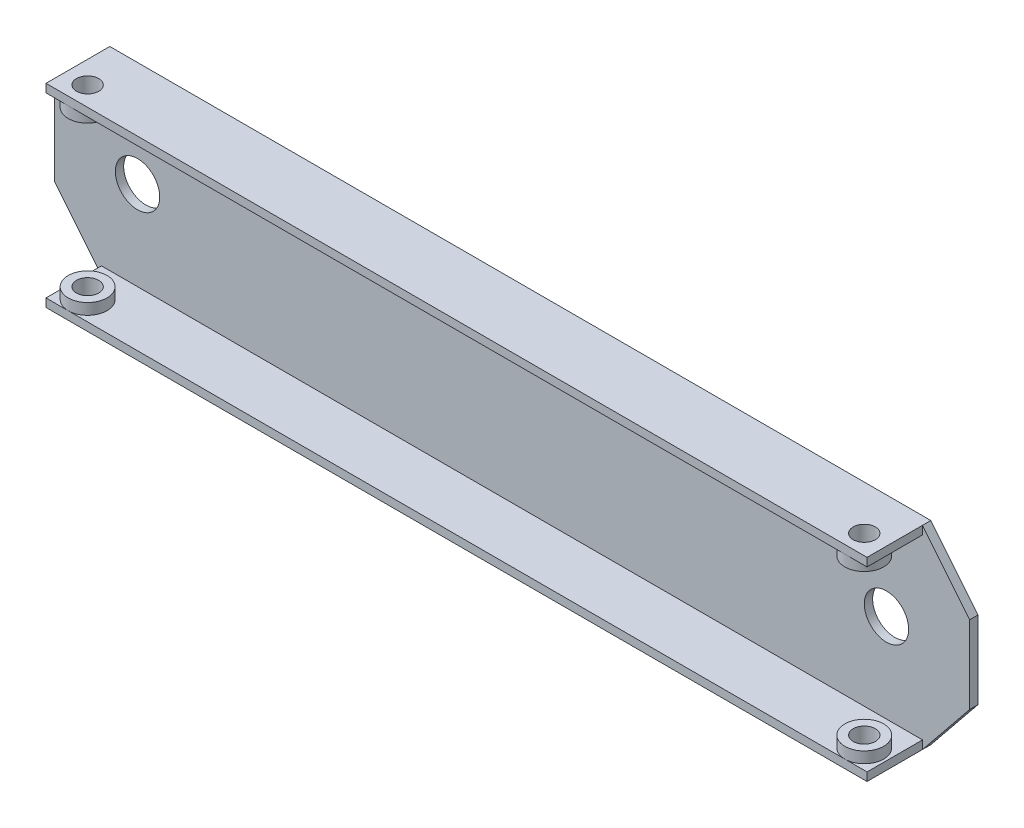
ISO-10303-21;
HEADER;
FILE_DESCRIPTION(('STEP AP214'),'2;1');
FILE_NAME('part.step','',(''),(''),'','','');
FILE_SCHEMA(('AUTOMOTIVE_DESIGN { 1 0 10303 214 1 1 1 1 }'));
ENDSEC;
DATA;
#1=APPLICATION_CONTEXT('core data for automotive mechanical design processes');
#2=APPLICATION_PROTOCOL_DEFINITION('international standard','automotive_design',2000,#1);
#3=PRODUCT_CONTEXT('',#1,'mechanical');
#4=PRODUCT('Part','Part','',(#3));
#5=PRODUCT_RELATED_PRODUCT_CATEGORY('part','',(#4));
#6=PRODUCT_DEFINITION_FORMATION('','',#4);
#7=PRODUCT_DEFINITION_CONTEXT('part definition',#1,'design');
#8=PRODUCT_DEFINITION('design','',#6,#7);
#9=PRODUCT_DEFINITION_SHAPE('','',#8);
#10=(LENGTH_UNIT() NAMED_UNIT(*) SI_UNIT(.MILLI.,.METRE.));
#11=(NAMED_UNIT(*) PLANE_ANGLE_UNIT() SI_UNIT($,.RADIAN.));
#12=(NAMED_UNIT(*) SI_UNIT($,.STERADIAN.) SOLID_ANGLE_UNIT());
#13=UNCERTAINTY_MEASURE_WITH_UNIT(LENGTH_MEASURE(1.E-05),#10,'distance_accuracy_value','');
#14=(GEOMETRIC_REPRESENTATION_CONTEXT(3) GLOBAL_UNCERTAINTY_ASSIGNED_CONTEXT((#13)) GLOBAL_UNIT_ASSIGNED_CONTEXT((#10,
#11,#12)) REPRESENTATION_CONTEXT('',''));
#15=CARTESIAN_POINT('',(0.,0.,0.));
#16=DIRECTION('',(0.,0.,1.));
#17=DIRECTION('',(1.,0.,0.));
#18=AXIS2_PLACEMENT_3D('',#15,#16,#17);
#19=CARTESIAN_POINT('',(-37.8850300015419,-6.6930632869667,11.5));
#20=DIRECTION('',(0.,-1.,0.));
#21=DIRECTION('',(0.,0.,-1.));
#22=AXIS2_PLACEMENT_3D('',#19,#20,#21);
#23=PLANE('',#22);
#24=DIRECTION('',(-1.,0.,0.));
#25=VECTOR('',#24,1.);
#26=CARTESIAN_POINT('',(-37.8850300015419,-6.6930632869667,11.5));
#27=LINE('',#26,#25);
#28=CARTESIAN_POINT('',(106.114969998458,-6.6930632869667,11.5));
#29=VERTEX_POINT('',#28);
#30=CARTESIAN_POINT('',(-33.8850300015419,-6.6930632869667,11.5));
#31=VERTEX_POINT('',#30);
#32=EDGE_CURVE('E150',#29,#31,#27,.T.);
#33=ORIENTED_EDGE('',*,*,#32,.F.);
#34=CARTESIAN_POINT('',(106.114969998458,-6.6930632869667,8.));
#35=DIRECTION('',(0.,1.,0.));
#36=DIRECTION('',(0.,0.,1.));
#37=AXIS2_PLACEMENT_3D('',#34,#35,#36);
#38=CIRCLE('',#37,3.49999999999999);
#39=EDGE_CURVE('E162',#29,#29,#38,.T.);
#40=ORIENTED_EDGE('',*,*,#39,.F.);
#41=CARTESIAN_POINT('',(110.114969998458,-6.6930632869667,11.5));
#42=VERTEX_POINT('',#41);
#43=EDGE_CURVE('E146',#42,#29,#27,.T.);
#44=ORIENTED_EDGE('',*,*,#43,.F.);
#45=DIRECTION('',(0.,0.,-1.));
#46=VECTOR('',#45,1.);
#47=CARTESIAN_POINT('',(110.114969998458,-6.6930632869667,11.5));
#48=LINE('',#47,#46);
#49=CARTESIAN_POINT('',(110.114969998458,-6.6930632869667,1.5));
#50=VERTEX_POINT('',#49);
#51=EDGE_CURVE('E181',#42,#50,#48,.T.);
#52=ORIENTED_EDGE('',*,*,#51,.T.);
#53=DIRECTION('',(-1.,0.,0.));
#54=VECTOR('',#53,1.);
#55=CARTESIAN_POINT('',(-37.8850300015419,-6.6930632869667,1.5));
#56=LINE('',#55,#54);
#57=CARTESIAN_POINT('',(-37.8850300015419,-6.6930632869667,1.5));
#58=VERTEX_POINT('',#57);
#59=EDGE_CURVE('E172',#50,#58,#56,.T.);
#60=ORIENTED_EDGE('',*,*,#59,.T.);
#61=DIRECTION('',(0.,0.,-1.));
#62=VECTOR('',#61,1.);
#63=CARTESIAN_POINT('',(-37.8850300015419,-6.6930632869667,11.5));
#64=LINE('',#63,#62);
#65=CARTESIAN_POINT('',(-37.8850300015419,-6.6930632869667,11.5));
#66=VERTEX_POINT('',#65);
#67=EDGE_CURVE('E48',#66,#58,#64,.T.);
#68=ORIENTED_EDGE('',*,*,#67,.F.);
#69=EDGE_CURVE('E159',#31,#66,#27,.T.);
#70=ORIENTED_EDGE('',*,*,#69,.F.);
#71=CARTESIAN_POINT('',(-33.8850300015419,-6.6930632869667,8.));
#72=DIRECTION('',(0.,1.,0.));
#73=DIRECTION('',(0.,0.,1.));
#74=AXIS2_PLACEMENT_3D('',#71,#72,#73);
#75=CIRCLE('',#74,3.5);
#76=EDGE_CURVE('E164',#31,#31,#75,.T.);
#77=ORIENTED_EDGE('',*,*,#76,.F.);
#78=EDGE_LOOP('',(#33,#40,#44,#52,#60,#68,#70,#77));
#79=FACE_BOUND('',#78,.T.);
#80=ADVANCED_FACE('F33',(#79),#23,.F.);
#81=CARTESIAN_POINT('',(-37.8850300015419,25.3069367130333,11.5));
#82=DIRECTION('',(0.,1.,0.));
#83=DIRECTION('',(0.,0.,1.));
#84=AXIS2_PLACEMENT_3D('',#81,#82,#83);
#85=PLANE('',#84);
#86=DIRECTION('',(1.,0.,0.));
#87=VECTOR('',#86,1.);
#88=CARTESIAN_POINT('',(-37.8850300015419,25.3069367130333,11.5));
#89=LINE('',#88,#87);
#90=CARTESIAN_POINT('',(106.114969998458,25.3069367130333,11.5));
#91=VERTEX_POINT('',#90);
#92=CARTESIAN_POINT('',(110.114969998458,25.3069367130333,11.5));
#93=VERTEX_POINT('',#92);
#94=EDGE_CURVE('E191',#91,#93,#89,.T.);
#95=ORIENTED_EDGE('',*,*,#94,.F.);
#96=CARTESIAN_POINT('',(106.114969998458,25.3069367130333,8.));
#97=DIRECTION('',(0.,-1.,0.));
#98=DIRECTION('',(0.,0.,-1.));
#99=AXIS2_PLACEMENT_3D('',#96,#97,#98);
#100=CIRCLE('',#99,3.49999999999999);
#101=EDGE_CURVE('E311',#91,#91,#100,.T.);
#102=ORIENTED_EDGE('',*,*,#101,.F.);
#103=CARTESIAN_POINT('',(-33.8850300015419,25.3069367130333,11.5));
#104=VERTEX_POINT('',#103);
#105=EDGE_CURVE('E195',#104,#91,#89,.T.);
#106=ORIENTED_EDGE('',*,*,#105,.F.);
#107=CARTESIAN_POINT('',(-33.8850300015419,25.3069367130333,8.));
#108=DIRECTION('',(0.,-1.,0.));
#109=DIRECTION('',(0.,0.,-1.));
#110=AXIS2_PLACEMENT_3D('',#107,#108,#109);
#111=CIRCLE('',#110,3.5);
#112=EDGE_CURVE('E302',#104,#104,#111,.T.);
#113=ORIENTED_EDGE('',*,*,#112,.F.);
#114=CARTESIAN_POINT('',(-37.8850300015419,25.3069367130333,11.5));
#115=VERTEX_POINT('',#114);
#116=EDGE_CURVE('E192',#115,#104,#89,.T.);
#117=ORIENTED_EDGE('',*,*,#116,.F.);
#118=DIRECTION('',(0.,0.,-1.));
#119=VECTOR('',#118,1.);
#120=CARTESIAN_POINT('',(-37.8850300015419,25.3069367130333,11.5));
#121=LINE('',#120,#119);
#122=CARTESIAN_POINT('',(-37.8850300015419,25.3069367130333,1.5));
#123=VERTEX_POINT('',#122);
#124=EDGE_CURVE('E208',#115,#123,#121,.T.);
#125=ORIENTED_EDGE('',*,*,#124,.T.);
#126=DIRECTION('',(1.,0.,0.));
#127=VECTOR('',#126,1.);
#128=CARTESIAN_POINT('',(-37.8850300015419,25.3069367130333,1.5));
#129=LINE('',#128,#127);
#130=CARTESIAN_POINT('',(110.114969998458,25.3069367130333,1.5));
#131=VERTEX_POINT('',#130);
#132=EDGE_CURVE('E200',#123,#131,#129,.T.);
#133=ORIENTED_EDGE('',*,*,#132,.T.);
#134=DIRECTION('',(0.,0.,-1.));
#135=VECTOR('',#134,1.);
#136=CARTESIAN_POINT('',(110.114969998458,25.3069367130333,11.5));
#137=LINE('',#136,#135);
#138=EDGE_CURVE('E205',#93,#131,#137,.T.);
#139=ORIENTED_EDGE('',*,*,#138,.F.);
#140=EDGE_LOOP('',(#95,#102,#106,#113,#117,#125,#133,#139));
#141=FACE_BOUND('',#140,.T.);
#142=ADVANCED_FACE('F357',(#141),#85,.F.);
#143=CARTESIAN_POINT('',(0.,0.,1.5));
#144=DIRECTION('',(0.,0.,1.));
#145=DIRECTION('',(1.,0.,0.));
#146=AXIS2_PLACEMENT_3D('',#143,#144,#145);
#147=PLANE('',#146);
#148=CARTESIAN_POINT('',(103.614969998458,9.3069367130333,1.5));
#149=DIRECTION('',(0.,0.,1.));
#150=DIRECTION('',(1.,0.,0.));
#151=AXIS2_PLACEMENT_3D('',#148,#149,#150);
#152=CIRCLE('',#151,4.00000000000001);
#153=CARTESIAN_POINT('',(107.614969998458,9.3069367130333,1.5));
#154=VERTEX_POINT('',#153);
#155=EDGE_CURVE('E348',#154,#154,#152,.T.);
#156=ORIENTED_EDGE('',*,*,#155,.F.);
#157=EDGE_LOOP('',(#156));
#158=FACE_BOUND('',#157,.T.);
#159=CARTESIAN_POINT('',(-31.3850300015419,9.30693671303331,1.5));
#160=DIRECTION('',(0.,0.,1.));
#161=DIRECTION('',(1.,0.,0.));
#162=AXIS2_PLACEMENT_3D('',#159,#160,#161);
#163=CIRCLE('',#162,4.);
#164=CARTESIAN_POINT('',(-27.3850300015419,9.30693671303331,1.5));
#165=VERTEX_POINT('',#164);
#166=EDGE_CURVE('E342',#165,#165,#163,.T.);
#167=ORIENTED_EDGE('',*,*,#166,.F.);
#168=EDGE_LOOP('',(#167));
#169=FACE_BOUND('',#168,.T.);
#170=ORIENTED_EDGE('',*,*,#59,.F.);
#171=DIRECTION('',(0.,1.,0.));
#172=VECTOR('',#171,1.);
#173=CARTESIAN_POINT('',(110.114969998458,-6.6930632869667,1.5));
#174=LINE('',#173,#172);
#175=CARTESIAN_POINT('',(110.114969998458,-8.19306328696669,1.5));
#176=VERTEX_POINT('',#175);
#177=EDGE_CURVE('E170',#176,#50,#174,.T.);
#178=ORIENTED_EDGE('',*,*,#177,.F.);
#179=DIRECTION('',(0.629198228667966,0.777244870707484,0.));
#180=VECTOR('',#179,1.);
#181=CARTESIAN_POINT('',(118.614969998458,2.30693671303332,1.5));
#182=LINE('',#181,#180);
#183=CARTESIAN_POINT('',(118.614969998458,2.30693671303332,1.5));
#184=VERTEX_POINT('',#183);
#185=EDGE_CURVE('E224',#176,#184,#182,.T.);
#186=ORIENTED_EDGE('',*,*,#185,.T.);
#187=DIRECTION('',(0.,1.,0.));
#188=VECTOR('',#187,1.);
#189=CARTESIAN_POINT('',(118.614969998458,16.3069367130333,1.5));
#190=LINE('',#189,#188);
#191=CARTESIAN_POINT('',(118.614969998458,16.3069367130333,1.5));
#192=VERTEX_POINT('',#191);
#193=EDGE_CURVE('E226',#184,#192,#190,.T.);
#194=ORIENTED_EDGE('',*,*,#193,.T.);
#195=DIRECTION('',(-0.629198228667965,0.777244870707485,0.));
#196=VECTOR('',#195,1.);
#197=CARTESIAN_POINT('',(110.114969998458,26.8069367130333,1.5));
#198=LINE('',#197,#196);
#199=CARTESIAN_POINT('',(110.114969998458,26.8069367130333,1.5));
#200=VERTEX_POINT('',#199);
#201=EDGE_CURVE('E228',#192,#200,#198,.T.);
#202=ORIENTED_EDGE('',*,*,#201,.T.);
#203=DIRECTION('',(0.,1.,0.));
#204=VECTOR('',#203,1.);
#205=CARTESIAN_POINT('',(110.114969998458,25.3069367130333,1.5));
#206=LINE('',#205,#204);
#207=EDGE_CURVE('E56',#131,#200,#206,.T.);
#208=ORIENTED_EDGE('',*,*,#207,.F.);
#209=ORIENTED_EDGE('',*,*,#132,.F.);
#210=DIRECTION('',(0.,-1.,0.));
#211=VECTOR('',#210,1.);
#212=CARTESIAN_POINT('',(-37.8850300015419,26.8069367130333,1.5));
#213=LINE('',#212,#211);
#214=CARTESIAN_POINT('',(-37.8850300015419,26.8069367130333,1.5));
#215=VERTEX_POINT('',#214);
#216=EDGE_CURVE('E185',#215,#123,#213,.T.);
#217=ORIENTED_EDGE('',*,*,#216,.F.);
#218=DIRECTION('',(-0.629198228667965,-0.777244870707485,0.));
#219=VECTOR('',#218,1.);
#220=CARTESIAN_POINT('',(-37.8850300015419,26.8069367130333,1.5));
#221=LINE('',#220,#219);
#222=CARTESIAN_POINT('',(-46.3850300015419,16.3069367130333,1.5));
#223=VERTEX_POINT('',#222);
#224=EDGE_CURVE('E215',#215,#223,#221,.T.);
#225=ORIENTED_EDGE('',*,*,#224,.T.);
#226=DIRECTION('',(0.,-1.,0.));
#227=VECTOR('',#226,1.);
#228=CARTESIAN_POINT('',(-46.3850300015419,16.3069367130333,1.5));
#229=LINE('',#228,#227);
#230=CARTESIAN_POINT('',(-46.3850300015419,2.3069367130333,1.5));
#231=VERTEX_POINT('',#230);
#232=EDGE_CURVE('E218',#223,#231,#229,.T.);
#233=ORIENTED_EDGE('',*,*,#232,.T.);
#234=DIRECTION('',(0.629198228667966,-0.777244870707484,0.));
#235=VECTOR('',#234,1.);
#236=CARTESIAN_POINT('',(-46.3850300015419,2.3069367130333,1.5));
#237=LINE('',#236,#235);
#238=CARTESIAN_POINT('',(-37.8850300015419,-8.1930632869667,1.5));
#239=VERTEX_POINT('',#238);
#240=EDGE_CURVE('E221',#231,#239,#237,.T.);
#241=ORIENTED_EDGE('',*,*,#240,.T.);
#242=DIRECTION('',(0.,-1.,0.));
#243=VECTOR('',#242,1.);
#244=CARTESIAN_POINT('',(-37.8850300015419,-8.1930632869667,1.5));
#245=LINE('',#244,#243);
#246=EDGE_CURVE('E175',#58,#239,#245,.T.);
#247=ORIENTED_EDGE('',*,*,#246,.F.);
#248=EDGE_LOOP('',(#170,#178,#186,#194,#202,#208,#209,#217,#225,#233,#241,#247));
#249=FACE_BOUND('',#248,.T.);
#250=ADVANCED_FACE('F287',(#158,#169,#249),#147,.T.);
#251=CARTESIAN_POINT('',(-37.8850300015419,26.8069367130333,1.5));
#252=DIRECTION('',(0.777244870707485,-0.629198228667965,0.));
#253=DIRECTION('',(0.629198228667965,0.777244870707485,0.));
#254=AXIS2_PLACEMENT_3D('',#251,#252,#253);
#255=PLANE('',#254);
#256=DIRECTION('',(-0.629198228667965,-0.777244870707485,0.));
#257=VECTOR('',#256,1.);
#258=CARTESIAN_POINT('',(-37.8850300015419,26.8069367130333,0.));
#259=LINE('',#258,#257);
#260=CARTESIAN_POINT('',(-37.8850300015419,26.8069367130333,0.));
#261=VERTEX_POINT('',#260);
#262=CARTESIAN_POINT('',(-46.3850300015419,16.3069367130333,0.));
#263=VERTEX_POINT('',#262);
#264=EDGE_CURVE('E214',#261,#263,#259,.T.);
#265=ORIENTED_EDGE('',*,*,#264,.T.);
#266=DIRECTION('',(0.,0.,-1.));
#267=VECTOR('',#266,1.);
#268=CARTESIAN_POINT('',(-46.3850300015419,16.3069367130333,1.5));
#269=LINE('',#268,#267);
#270=EDGE_CURVE('E11',#223,#263,#269,.T.);
#271=ORIENTED_EDGE('',*,*,#270,.F.);
#272=ORIENTED_EDGE('',*,*,#224,.F.);
#273=DIRECTION('',(0.,0.,-1.));
#274=VECTOR('',#273,1.);
#275=CARTESIAN_POINT('',(-37.8850300015419,26.8069367130333,1.5));
#276=LINE('',#275,#274);
#277=EDGE_CURVE('E230',#215,#261,#276,.T.);
#278=ORIENTED_EDGE('',*,*,#277,.T.);
#279=EDGE_LOOP('',(#265,#271,#272,#278));
#280=FACE_BOUND('',#279,.T.);
#281=ADVANCED_FACE('F35',(#280),#255,.F.);
#282=CARTESIAN_POINT('',(-46.3850300015419,16.3069367130333,1.5));
#283=DIRECTION('',(1.,0.,0.));
#284=DIRECTION('',(0.,1.,0.));
#285=AXIS2_PLACEMENT_3D('',#282,#283,#284);
#286=PLANE('',#285);
#287=DIRECTION('',(0.,-1.,0.));
#288=VECTOR('',#287,1.);
#289=CARTESIAN_POINT('',(-46.3850300015419,16.3069367130333,0.));
#290=LINE('',#289,#288);
#291=CARTESIAN_POINT('',(-46.3850300015419,2.3069367130333,0.));
#292=VERTEX_POINT('',#291);
#293=EDGE_CURVE('E233',#263,#292,#290,.T.);
#294=ORIENTED_EDGE('',*,*,#293,.T.);
#295=DIRECTION('',(0.,0.,-1.));
#296=VECTOR('',#295,1.);
#297=CARTESIAN_POINT('',(-46.3850300015419,2.3069367130333,1.5));
#298=LINE('',#297,#296);
#299=EDGE_CURVE('E41',#231,#292,#298,.T.);
#300=ORIENTED_EDGE('',*,*,#299,.F.);
#301=ORIENTED_EDGE('',*,*,#232,.F.);
#302=ORIENTED_EDGE('',*,*,#270,.T.);
#303=EDGE_LOOP('',(#294,#300,#301,#302));
#304=FACE_BOUND('',#303,.T.);
#305=ADVANCED_FACE('F616',(#304),#286,.F.);
#306=CARTESIAN_POINT('',(-46.3850300015419,2.3069367130333,1.5));
#307=DIRECTION('',(0.777244870707484,0.629198228667966,0.));
#308=DIRECTION('',(-0.629198228667966,0.777244870707484,0.));
#309=AXIS2_PLACEMENT_3D('',#306,#307,#308);
#310=PLANE('',#309);
#311=DIRECTION('',(0.629198228667966,-0.777244870707484,0.));
#312=VECTOR('',#311,1.);
#313=CARTESIAN_POINT('',(-46.3850300015419,2.3069367130333,0.));
#314=LINE('',#313,#312);
#315=CARTESIAN_POINT('',(-37.8850300015419,-8.1930632869667,0.));
#316=VERTEX_POINT('',#315);
#317=EDGE_CURVE('E235',#292,#316,#314,.T.);
#318=ORIENTED_EDGE('',*,*,#317,.T.);
#319=DIRECTION('',(0.,0.,-1.));
#320=VECTOR('',#319,1.);
#321=CARTESIAN_POINT('',(-37.8850300015419,-8.1930632869667,1.5));
#322=LINE('',#321,#320);
#323=EDGE_CURVE('E260',#239,#316,#322,.T.);
#324=ORIENTED_EDGE('',*,*,#323,.F.);
#325=ORIENTED_EDGE('',*,*,#240,.F.);
#326=ORIENTED_EDGE('',*,*,#299,.T.);
#327=EDGE_LOOP('',(#318,#324,#325,#326));
#328=FACE_BOUND('',#327,.T.);
#329=ADVANCED_FACE('F267',(#328),#310,.F.);
#330=CARTESIAN_POINT('',(-37.8850300015419,-8.1930632869667,1.5));
#331=DIRECTION('',(0.,1.,0.));
#332=DIRECTION('',(-1.,0.,0.));
#333=AXIS2_PLACEMENT_3D('',#330,#331,#332);
#334=PLANE('',#333);
#335=CARTESIAN_POINT('',(106.114969998458,-8.1930632869667,8.));
#336=DIRECTION('',(0.,-1.,0.));
#337=DIRECTION('',(0.,0.,-1.));
#338=AXIS2_PLACEMENT_3D('',#335,#336,#337);
#339=CIRCLE('',#338,2.);
#340=CARTESIAN_POINT('',(106.114969998458,-8.1930632869667,6.));
#341=VERTEX_POINT('',#340);
#342=EDGE_CURVE('E329',#341,#341,#339,.T.);
#343=ORIENTED_EDGE('',*,*,#342,.F.);
#344=EDGE_LOOP('',(#343));
#345=FACE_BOUND('',#344,.T.);
#346=CARTESIAN_POINT('',(-33.8850300015419,-8.1930632869667,8.));
#347=DIRECTION('',(0.,-1.,0.));
#348=DIRECTION('',(0.,0.,-1.));
#349=AXIS2_PLACEMENT_3D('',#346,#347,#348);
#350=CIRCLE('',#349,2.);
#351=CARTESIAN_POINT('',(-33.8850300015419,-8.1930632869667,6.));
#352=VERTEX_POINT('',#351);
#353=EDGE_CURVE('E319',#352,#352,#350,.T.);
#354=ORIENTED_EDGE('',*,*,#353,.F.);
#355=EDGE_LOOP('',(#354));
#356=FACE_BOUND('',#355,.T.);
#357=DIRECTION('',(1.,0.,0.));
#358=VECTOR('',#357,1.);
#359=CARTESIAN_POINT('',(-37.8850300015419,-8.1930632869667,0.));
#360=LINE('',#359,#358);
#361=CARTESIAN_POINT('',(110.114969998458,-8.19306328696669,0.));
#362=VERTEX_POINT('',#361);
#363=EDGE_CURVE('E237',#316,#362,#360,.T.);
#364=ORIENTED_EDGE('',*,*,#363,.T.);
#365=DIRECTION('',(0.,0.,-1.));
#366=VECTOR('',#365,1.);
#367=CARTESIAN_POINT('',(110.114969998458,-8.19306328696669,1.5));
#368=LINE('',#367,#366);
#369=EDGE_CURVE('E257',#176,#362,#368,.T.);
#370=ORIENTED_EDGE('',*,*,#369,.F.);
#371=DIRECTION('',(0.,0.,-1.));
#372=VECTOR('',#371,1.);
#373=CARTESIAN_POINT('',(110.114969998458,-8.19306328696669,11.5));
#374=LINE('',#373,#372);
#375=CARTESIAN_POINT('',(110.114969998458,-8.19306328696669,11.5));
#376=VERTEX_POINT('',#375);
#377=EDGE_CURVE('E183',#376,#176,#374,.T.);
#378=ORIENTED_EDGE('',*,*,#377,.F.);
#379=DIRECTION('',(1.,0.,0.));
#380=VECTOR('',#379,1.);
#381=CARTESIAN_POINT('',(110.114969998458,-8.19306328696669,11.5));
#382=LINE('',#381,#380);
#383=CARTESIAN_POINT('',(-37.8850300015419,-8.1930632869667,11.5));
#384=VERTEX_POINT('',#383);
#385=EDGE_CURVE('E177',#384,#376,#382,.T.);
#386=ORIENTED_EDGE('',*,*,#385,.F.);
#387=DIRECTION('',(0.,0.,-1.));
#388=VECTOR('',#387,1.);
#389=CARTESIAN_POINT('',(-37.8850300015419,-8.1930632869667,11.5));
#390=LINE('',#389,#388);
#391=EDGE_CURVE('E169',#384,#239,#390,.T.);
#392=ORIENTED_EDGE('',*,*,#391,.T.);
#393=ORIENTED_EDGE('',*,*,#323,.T.);
#394=EDGE_LOOP('',(#364,#370,#378,#386,#392,#393));
#395=FACE_BOUND('',#394,.T.);
#396=ADVANCED_FACE('F278',(#345,#356,#395),#334,.F.);
#397=CARTESIAN_POINT('',(118.614969998458,2.30693671303332,1.5));
#398=DIRECTION('',(-0.777244870707484,0.629198228667966,0.));
#399=DIRECTION('',(-0.629198228667966,-0.777244870707484,0.));
#400=AXIS2_PLACEMENT_3D('',#397,#398,#399);
#401=PLANE('',#400);
#402=DIRECTION('',(0.629198228667966,0.777244870707484,0.));
#403=VECTOR('',#402,1.);
#404=CARTESIAN_POINT('',(118.614969998458,2.30693671303332,0.));
#405=LINE('',#404,#403);
#406=CARTESIAN_POINT('',(118.614969998458,2.30693671303332,0.));
#407=VERTEX_POINT('',#406);
#408=EDGE_CURVE('E239',#362,#407,#405,.T.);
#409=ORIENTED_EDGE('',*,*,#408,.T.);
#410=DIRECTION('',(0.,0.,-1.));
#411=VECTOR('',#410,1.);
#412=CARTESIAN_POINT('',(118.614969998458,2.30693671303332,1.5));
#413=LINE('',#412,#411);
#414=EDGE_CURVE('E254',#184,#407,#413,.T.);
#415=ORIENTED_EDGE('',*,*,#414,.F.);
#416=ORIENTED_EDGE('',*,*,#185,.F.);
#417=ORIENTED_EDGE('',*,*,#369,.T.);
#418=EDGE_LOOP('',(#409,#415,#416,#417));
#419=FACE_BOUND('',#418,.T.);
#420=ADVANCED_FACE('F282',(#419),#401,.F.);
#421=CARTESIAN_POINT('',(118.614969998458,16.3069367130333,1.5));
#422=DIRECTION('',(-1.,0.,0.));
#423=DIRECTION('',(0.,-1.,0.));
#424=AXIS2_PLACEMENT_3D('',#421,#422,#423);
#425=PLANE('',#424);
#426=DIRECTION('',(0.,1.,0.));
#427=VECTOR('',#426,1.);
#428=CARTESIAN_POINT('',(118.614969998458,16.3069367130333,0.));
#429=LINE('',#428,#427);
#430=CARTESIAN_POINT('',(118.614969998458,16.3069367130333,0.));
#431=VERTEX_POINT('',#430);
#432=EDGE_CURVE('E241',#407,#431,#429,.T.);
#433=ORIENTED_EDGE('',*,*,#432,.T.);
#434=DIRECTION('',(0.,0.,-1.));
#435=VECTOR('',#434,1.);
#436=CARTESIAN_POINT('',(118.614969998458,16.3069367130333,1.5));
#437=LINE('',#436,#435);
#438=EDGE_CURVE('E251',#192,#431,#437,.T.);
#439=ORIENTED_EDGE('',*,*,#438,.F.);
#440=ORIENTED_EDGE('',*,*,#193,.F.);
#441=ORIENTED_EDGE('',*,*,#414,.T.);
#442=EDGE_LOOP('',(#433,#439,#440,#441));
#443=FACE_BOUND('',#442,.T.);
#444=ADVANCED_FACE('F625',(#443),#425,.F.);
#445=CARTESIAN_POINT('',(110.114969998458,26.8069367130333,1.5));
#446=DIRECTION('',(-0.777244870707485,-0.629198228667965,0.));
#447=DIRECTION('',(0.629198228667965,-0.777244870707485,0.));
#448=AXIS2_PLACEMENT_3D('',#445,#446,#447);
#449=PLANE('',#448);
#450=DIRECTION('',(-0.629198228667965,0.777244870707485,0.));
#451=VECTOR('',#450,1.);
#452=CARTESIAN_POINT('',(110.114969998458,26.8069367130333,0.));
#453=LINE('',#452,#451);
#454=CARTESIAN_POINT('',(110.114969998458,26.8069367130333,0.));
#455=VERTEX_POINT('',#454);
#456=EDGE_CURVE('E243',#431,#455,#453,.T.);
#457=ORIENTED_EDGE('',*,*,#456,.T.);
#458=DIRECTION('',(0.,0.,-1.));
#459=VECTOR('',#458,1.);
#460=CARTESIAN_POINT('',(110.114969998458,26.8069367130333,1.5));
#461=LINE('',#460,#459);
#462=EDGE_CURVE('E248',#200,#455,#461,.T.);
#463=ORIENTED_EDGE('',*,*,#462,.F.);
#464=ORIENTED_EDGE('',*,*,#201,.F.);
#465=ORIENTED_EDGE('',*,*,#438,.T.);
#466=EDGE_LOOP('',(#457,#463,#464,#465));
#467=FACE_BOUND('',#466,.T.);
#468=ADVANCED_FACE('F380',(#467),#449,.F.);
#469=CARTESIAN_POINT('',(-37.8850300015419,26.8069367130333,1.5));
#470=DIRECTION('',(0.,-1.,0.));
#471=DIRECTION('',(1.,0.,0.));
#472=AXIS2_PLACEMENT_3D('',#469,#470,#471);
#473=PLANE('',#472);
#474=CARTESIAN_POINT('',(-33.8850300015419,26.8069367130333,8.));
#475=DIRECTION('',(0.,1.,0.));
#476=DIRECTION('',(0.,0.,1.));
#477=AXIS2_PLACEMENT_3D('',#474,#475,#476);
#478=CIRCLE('',#477,2.);
#479=CARTESIAN_POINT('',(-33.8850300015419,26.8069367130333,10.));
#480=VERTEX_POINT('',#479);
#481=EDGE_CURVE('E298',#480,#480,#478,.T.);
#482=ORIENTED_EDGE('',*,*,#481,.F.);
#483=EDGE_LOOP('',(#482));
#484=FACE_BOUND('',#483,.T.);
#485=CARTESIAN_POINT('',(106.114969998458,26.8069367130333,8.));
#486=DIRECTION('',(0.,1.,0.));
#487=DIRECTION('',(0.,0.,1.));
#488=AXIS2_PLACEMENT_3D('',#485,#486,#487);
#489=CIRCLE('',#488,2.);
#490=CARTESIAN_POINT('',(106.114969998458,26.8069367130333,10.));
#491=VERTEX_POINT('',#490);
#492=EDGE_CURVE('E173',#491,#491,#489,.T.);
#493=ORIENTED_EDGE('',*,*,#492,.F.);
#494=EDGE_LOOP('',(#493));
#495=FACE_BOUND('',#494,.T.);
#496=DIRECTION('',(-1.,0.,0.));
#497=VECTOR('',#496,1.);
#498=CARTESIAN_POINT('',(-37.8850300015419,26.8069367130333,0.));
#499=LINE('',#498,#497);
#500=EDGE_CURVE('E219',#455,#261,#499,.T.);
#501=ORIENTED_EDGE('',*,*,#500,.T.);
#502=ORIENTED_EDGE('',*,*,#277,.F.);
#503=DIRECTION('',(0.,0.,-1.));
#504=VECTOR('',#503,1.);
#505=CARTESIAN_POINT('',(-37.8850300015419,26.8069367130333,11.5));
#506=LINE('',#505,#504);
#507=CARTESIAN_POINT('',(-37.8850300015419,26.8069367130333,11.5));
#508=VERTEX_POINT('',#507);
#509=EDGE_CURVE('E211',#508,#215,#506,.T.);
#510=ORIENTED_EDGE('',*,*,#509,.F.);
#511=DIRECTION('',(-1.,0.,0.));
#512=VECTOR('',#511,1.);
#513=CARTESIAN_POINT('',(110.114969998458,26.8069367130333,11.5));
#514=LINE('',#513,#512);
#515=CARTESIAN_POINT('',(110.114969998458,26.8069367130333,11.5));
#516=VERTEX_POINT('',#515);
#517=EDGE_CURVE('E186',#516,#508,#514,.T.);
#518=ORIENTED_EDGE('',*,*,#517,.F.);
#519=DIRECTION('',(0.,0.,-1.));
#520=VECTOR('',#519,1.);
#521=CARTESIAN_POINT('',(110.114969998458,26.8069367130333,11.5));
#522=LINE('',#521,#520);
#523=EDGE_CURVE('E197',#516,#200,#522,.T.);
#524=ORIENTED_EDGE('',*,*,#523,.T.);
#525=ORIENTED_EDGE('',*,*,#462,.T.);
#526=EDGE_LOOP('',(#501,#502,#510,#518,#524,#525));
#527=FACE_BOUND('',#526,.T.);
#528=ADVANCED_FACE('F370',(#484,#495,#527),#473,.F.);
#529=CARTESIAN_POINT('',(0.,0.,0.));
#530=DIRECTION('',(0.,0.,1.));
#531=DIRECTION('',(1.,0.,0.));
#532=AXIS2_PLACEMENT_3D('',#529,#530,#531);
#533=PLANE('',#532);
#534=CARTESIAN_POINT('',(103.614969998458,9.3069367130333,0.));
#535=DIRECTION('',(0.,0.,1.));
#536=DIRECTION('',(1.,0.,0.));
#537=AXIS2_PLACEMENT_3D('',#534,#535,#536);
#538=CIRCLE('',#537,4.00000000000001);
#539=CARTESIAN_POINT('',(107.614969998458,9.3069367130333,0.));
#540=VERTEX_POINT('',#539);
#541=EDGE_CURVE('E345',#540,#540,#538,.F.);
#542=ORIENTED_EDGE('',*,*,#541,.F.);
#543=EDGE_LOOP('',(#542));
#544=FACE_BOUND('',#543,.T.);
#545=CARTESIAN_POINT('',(-31.3850300015419,9.30693671303331,0.));
#546=DIRECTION('',(0.,0.,1.));
#547=DIRECTION('',(1.,0.,0.));
#548=AXIS2_PLACEMENT_3D('',#545,#546,#547);
#549=CIRCLE('',#548,4.);
#550=CARTESIAN_POINT('',(-27.3850300015419,9.30693671303331,0.));
#551=VERTEX_POINT('',#550);
#552=EDGE_CURVE('E339',#551,#551,#549,.F.);
#553=ORIENTED_EDGE('',*,*,#552,.F.);
#554=EDGE_LOOP('',(#553));
#555=FACE_BOUND('',#554,.T.);
#556=ORIENTED_EDGE('',*,*,#264,.F.);
#557=ORIENTED_EDGE('',*,*,#500,.F.);
#558=ORIENTED_EDGE('',*,*,#456,.F.);
#559=ORIENTED_EDGE('',*,*,#432,.F.);
#560=ORIENTED_EDGE('',*,*,#408,.F.);
#561=ORIENTED_EDGE('',*,*,#363,.F.);
#562=ORIENTED_EDGE('',*,*,#317,.F.);
#563=ORIENTED_EDGE('',*,*,#293,.F.);
#564=EDGE_LOOP('',(#556,#557,#558,#559,#560,#561,#562,#563));
#565=FACE_BOUND('',#564,.T.);
#566=ADVANCED_FACE('F273',(#544,#555,#565),#533,.F.);
#567=CARTESIAN_POINT('',(-37.8850300015419,26.8069367130333,11.5));
#568=DIRECTION('',(1.,0.,0.));
#569=DIRECTION('',(0.,0.,-1.));
#570=AXIS2_PLACEMENT_3D('',#567,#568,#569);
#571=PLANE('',#570);
#572=ORIENTED_EDGE('',*,*,#216,.T.);
#573=ORIENTED_EDGE('',*,*,#124,.F.);
#574=DIRECTION('',(0.,-1.,0.));
#575=VECTOR('',#574,1.);
#576=CARTESIAN_POINT('',(-37.8850300015419,26.8069367130333,11.5));
#577=LINE('',#576,#575);
#578=EDGE_CURVE('E189',#508,#115,#577,.T.);
#579=ORIENTED_EDGE('',*,*,#578,.F.);
#580=ORIENTED_EDGE('',*,*,#509,.T.);
#581=EDGE_LOOP('',(#572,#573,#579,#580));
#582=FACE_BOUND('',#581,.T.);
#583=ADVANCED_FACE('F369',(#582),#571,.F.);
#584=CARTESIAN_POINT('',(110.114969998458,25.3069367130333,11.5));
#585=DIRECTION('',(-1.,0.,0.));
#586=DIRECTION('',(0.,0.,1.));
#587=AXIS2_PLACEMENT_3D('',#584,#585,#586);
#588=PLANE('',#587);
#589=ORIENTED_EDGE('',*,*,#207,.T.);
#590=ORIENTED_EDGE('',*,*,#523,.F.);
#591=DIRECTION('',(0.,1.,0.));
#592=VECTOR('',#591,1.);
#593=CARTESIAN_POINT('',(110.114969998458,25.3069367130333,11.5));
#594=LINE('',#593,#592);
#595=EDGE_CURVE('E194',#93,#516,#594,.T.);
#596=ORIENTED_EDGE('',*,*,#595,.F.);
#597=ORIENTED_EDGE('',*,*,#138,.T.);
#598=EDGE_LOOP('',(#589,#590,#596,#597));
#599=FACE_BOUND('',#598,.T.);
#600=ADVANCED_FACE('F377',(#599),#588,.F.);
#601=CARTESIAN_POINT('',(0.,0.,11.5));
#602=DIRECTION('',(0.,0.,1.));
#603=DIRECTION('',(1.,0.,0.));
#604=AXIS2_PLACEMENT_3D('',#601,#602,#603);
#605=PLANE('',#604);
#606=ORIENTED_EDGE('',*,*,#517,.T.);
#607=ORIENTED_EDGE('',*,*,#578,.T.);
#608=ORIENTED_EDGE('',*,*,#116,.T.);
#609=ORIENTED_EDGE('',*,*,#105,.T.);
#610=ORIENTED_EDGE('',*,*,#94,.T.);
#611=ORIENTED_EDGE('',*,*,#595,.T.);
#612=EDGE_LOOP('',(#606,#607,#608,#609,#610,#611));
#613=FACE_BOUND('',#612,.T.);
#614=ADVANCED_FACE('F396',(#613),#605,.T.);
#615=CARTESIAN_POINT('',(110.114969998458,-6.6930632869667,11.5));
#616=DIRECTION('',(-1.,0.,0.));
#617=DIRECTION('',(0.,0.,1.));
#618=AXIS2_PLACEMENT_3D('',#615,#616,#617);
#619=PLANE('',#618);
#620=ORIENTED_EDGE('',*,*,#177,.T.);
#621=ORIENTED_EDGE('',*,*,#51,.F.);
#622=DIRECTION('',(0.,1.,0.));
#623=VECTOR('',#622,1.);
#624=CARTESIAN_POINT('',(110.114969998458,-6.6930632869667,11.5));
#625=LINE('',#624,#623);
#626=EDGE_CURVE('E152',#376,#42,#625,.T.);
#627=ORIENTED_EDGE('',*,*,#626,.F.);
#628=ORIENTED_EDGE('',*,*,#377,.T.);
#629=EDGE_LOOP('',(#620,#621,#627,#628));
#630=FACE_BOUND('',#629,.T.);
#631=ADVANCED_FACE('F291',(#630),#619,.F.);
#632=CARTESIAN_POINT('',(-37.8850300015419,-8.1930632869667,11.5));
#633=DIRECTION('',(1.,0.,0.));
#634=DIRECTION('',(0.,0.,-1.));
#635=AXIS2_PLACEMENT_3D('',#632,#633,#634);
#636=PLANE('',#635);
#637=ORIENTED_EDGE('',*,*,#246,.T.);
#638=ORIENTED_EDGE('',*,*,#391,.F.);
#639=DIRECTION('',(0.,-1.,0.));
#640=VECTOR('',#639,1.);
#641=CARTESIAN_POINT('',(-37.8850300015419,-8.1930632869667,11.5));
#642=LINE('',#641,#640);
#643=EDGE_CURVE('E157',#66,#384,#642,.T.);
#644=ORIENTED_EDGE('',*,*,#643,.F.);
#645=ORIENTED_EDGE('',*,*,#67,.T.);
#646=EDGE_LOOP('',(#637,#638,#644,#645));
#647=FACE_BOUND('',#646,.T.);
#648=ADVANCED_FACE('F293',(#647),#636,.F.);
#649=CARTESIAN_POINT('',(0.,0.,11.5));
#650=DIRECTION('',(0.,0.,-1.));
#651=DIRECTION('',(-1.,0.,0.));
#652=AXIS2_PLACEMENT_3D('',#649,#650,#651);
#653=PLANE('',#652);
#654=ORIENTED_EDGE('',*,*,#385,.T.);
#655=ORIENTED_EDGE('',*,*,#626,.T.);
#656=ORIENTED_EDGE('',*,*,#43,.T.);
#657=ORIENTED_EDGE('',*,*,#32,.T.);
#658=ORIENTED_EDGE('',*,*,#69,.T.);
#659=ORIENTED_EDGE('',*,*,#643,.T.);
#660=EDGE_LOOP('',(#654,#655,#656,#657,#658,#659));
#661=FACE_BOUND('',#660,.T.);
#662=ADVANCED_FACE('F149',(#661),#653,.F.);
#663=CARTESIAN_POINT('',(106.114969998458,23.3069367130333,8.));
#664=DIRECTION('',(0.,1.,0.));
#665=DIRECTION('',(0.,0.,1.));
#666=AXIS2_PLACEMENT_3D('',#663,#664,#665);
#667=CYLINDRICAL_SURFACE('',#666,2.);
#668=ORIENTED_EDGE('',*,*,#492,.T.);
#669=EDGE_LOOP('',(#668));
#670=FACE_BOUND('',#669,.T.);
#671=CARTESIAN_POINT('',(106.114969998458,23.3069367130333,8.));
#672=DIRECTION('',(0.,-1.,0.));
#673=DIRECTION('',(0.,0.,-1.));
#674=AXIS2_PLACEMENT_3D('',#671,#672,#673);
#675=CIRCLE('',#674,2.);
#676=CARTESIAN_POINT('',(106.114969998458,23.3069367130333,6.));
#677=VERTEX_POINT('',#676);
#678=EDGE_CURVE('E314',#677,#677,#675,.T.);
#679=ORIENTED_EDGE('',*,*,#678,.T.);
#680=EDGE_LOOP('',(#679));
#681=FACE_BOUND('',#680,.T.);
#682=ADVANCED_FACE('F445',(#670,#681),#667,.F.);
#683=CARTESIAN_POINT('',(-33.8850300015419,23.3069367130333,8.));
#684=DIRECTION('',(0.,1.,0.));
#685=DIRECTION('',(0.,0.,1.));
#686=AXIS2_PLACEMENT_3D('',#683,#684,#685);
#687=CYLINDRICAL_SURFACE('',#686,2.);
#688=ORIENTED_EDGE('',*,*,#481,.T.);
#689=EDGE_LOOP('',(#688));
#690=FACE_BOUND('',#689,.T.);
#691=CARTESIAN_POINT('',(-33.8850300015419,23.3069367130333,8.));
#692=DIRECTION('',(0.,-1.,0.));
#693=DIRECTION('',(0.,0.,-1.));
#694=AXIS2_PLACEMENT_3D('',#691,#692,#693);
#695=CIRCLE('',#694,2.);
#696=CARTESIAN_POINT('',(-33.8850300015419,23.3069367130333,6.));
#697=VERTEX_POINT('',#696);
#698=EDGE_CURVE('E305',#697,#697,#695,.T.);
#699=ORIENTED_EDGE('',*,*,#698,.T.);
#700=EDGE_LOOP('',(#699));
#701=FACE_BOUND('',#700,.T.);
#702=ADVANCED_FACE('F441',(#690,#701),#687,.F.);
#703=CARTESIAN_POINT('',(-33.8850300015419,23.3069367130333,8.));
#704=DIRECTION('',(0.,1.,0.));
#705=DIRECTION('',(0.,0.,1.));
#706=AXIS2_PLACEMENT_3D('',#703,#704,#705);
#707=CYLINDRICAL_SURFACE('',#706,3.5);
#708=CARTESIAN_POINT('',(-33.8850300015419,23.3069367130333,8.));
#709=DIRECTION('',(0.,-1.,0.));
#710=DIRECTION('',(0.,0.,-1.));
#711=AXIS2_PLACEMENT_3D('',#708,#709,#710);
#712=CIRCLE('',#711,3.5);
#713=CARTESIAN_POINT('',(-33.8850300015419,23.3069367130333,4.5));
#714=VERTEX_POINT('',#713);
#715=EDGE_CURVE('E301',#714,#714,#712,.T.);
#716=ORIENTED_EDGE('',*,*,#715,.F.);
#717=EDGE_LOOP('',(#716));
#718=FACE_BOUND('',#717,.T.);
#719=ORIENTED_EDGE('',*,*,#112,.T.);
#720=EDGE_LOOP('',(#719));
#721=FACE_BOUND('',#720,.T.);
#722=ADVANCED_FACE('F433',(#718,#721),#707,.T.);
#723=CARTESIAN_POINT('',(-33.8850300015419,23.3069367130333,8.));
#724=DIRECTION('',(0.,-1.,0.));
#725=DIRECTION('',(0.,0.,-1.));
#726=AXIS2_PLACEMENT_3D('',#723,#724,#725);
#727=PLANE('',#726);
#728=ORIENTED_EDGE('',*,*,#698,.F.);
#729=EDGE_LOOP('',(#728));
#730=FACE_BOUND('',#729,.T.);
#731=ORIENTED_EDGE('',*,*,#715,.T.);
#732=EDGE_LOOP('',(#731));
#733=FACE_BOUND('',#732,.T.);
#734=ADVANCED_FACE('F423',(#730,#733),#727,.T.);
#735=CARTESIAN_POINT('',(106.114969998458,23.3069367130333,8.));
#736=DIRECTION('',(0.,1.,0.));
#737=DIRECTION('',(0.,0.,1.));
#738=AXIS2_PLACEMENT_3D('',#735,#736,#737);
#739=CYLINDRICAL_SURFACE('',#738,3.49999999999999);
#740=CARTESIAN_POINT('',(106.114969998458,23.3069367130333,8.));
#741=DIRECTION('',(0.,-1.,0.));
#742=DIRECTION('',(0.,0.,-1.));
#743=AXIS2_PLACEMENT_3D('',#740,#741,#742);
#744=CIRCLE('',#743,3.49999999999999);
#745=CARTESIAN_POINT('',(106.114969998458,23.3069367130333,4.50000000000001));
#746=VERTEX_POINT('',#745);
#747=EDGE_CURVE('E310',#746,#746,#744,.T.);
#748=ORIENTED_EDGE('',*,*,#747,.F.);
#749=EDGE_LOOP('',(#748));
#750=FACE_BOUND('',#749,.T.);
#751=ORIENTED_EDGE('',*,*,#101,.T.);
#752=EDGE_LOOP('',(#751));
#753=FACE_BOUND('',#752,.T.);
#754=ADVANCED_FACE('F420',(#750,#753),#739,.T.);
#755=CARTESIAN_POINT('',(106.114969998458,23.3069367130333,8.));
#756=DIRECTION('',(0.,-1.,0.));
#757=DIRECTION('',(0.,0.,-1.));
#758=AXIS2_PLACEMENT_3D('',#755,#756,#757);
#759=PLANE('',#758);
#760=ORIENTED_EDGE('',*,*,#678,.F.);
#761=EDGE_LOOP('',(#760));
#762=FACE_BOUND('',#761,.T.);
#763=ORIENTED_EDGE('',*,*,#747,.T.);
#764=EDGE_LOOP('',(#763));
#765=FACE_BOUND('',#764,.T.);
#766=ADVANCED_FACE('F422',(#762,#765),#759,.T.);
#767=CARTESIAN_POINT('',(-33.8850300015419,26.8079367130333,8.));
#768=DIRECTION('',(0.,-1.,0.));
#769=DIRECTION('',(0.,0.,-1.));
#770=AXIS2_PLACEMENT_3D('',#767,#768,#769);
#771=CYLINDRICAL_SURFACE('',#770,2.);
#772=ORIENTED_EDGE('',*,*,#353,.T.);
#773=EDGE_LOOP('',(#772));
#774=FACE_BOUND('',#773,.T.);
#775=CARTESIAN_POINT('',(-33.8850300015419,-4.6930632869667,8.));
#776=DIRECTION('',(0.,1.,0.));
#777=DIRECTION('',(0.,0.,1.));
#778=AXIS2_PLACEMENT_3D('',#775,#776,#777);
#779=CIRCLE('',#778,2.);
#780=CARTESIAN_POINT('',(-33.8850300015419,-4.6930632869667,10.));
#781=VERTEX_POINT('',#780);
#782=EDGE_CURVE('E324',#781,#781,#779,.T.);
#783=ORIENTED_EDGE('',*,*,#782,.T.);
#784=EDGE_LOOP('',(#783));
#785=FACE_BOUND('',#784,.T.);
#786=ADVANCED_FACE('F430',(#774,#785),#771,.F.);
#787=CARTESIAN_POINT('',(-33.8850300015419,-4.6930632869667,8.));
#788=DIRECTION('',(0.,-1.,0.));
#789=DIRECTION('',(0.,0.,-1.));
#790=AXIS2_PLACEMENT_3D('',#787,#788,#789);
#791=CYLINDRICAL_SURFACE('',#790,3.5);
#792=CARTESIAN_POINT('',(-33.8850300015419,-4.6930632869667,8.));
#793=DIRECTION('',(0.,1.,0.));
#794=DIRECTION('',(0.,0.,1.));
#795=AXIS2_PLACEMENT_3D('',#792,#793,#794);
#796=CIRCLE('',#795,3.5);
#797=CARTESIAN_POINT('',(-33.8850300015419,-4.6930632869667,11.5));
#798=VERTEX_POINT('',#797);
#799=EDGE_CURVE('E322',#798,#798,#796,.T.);
#800=ORIENTED_EDGE('',*,*,#799,.F.);
#801=EDGE_LOOP('',(#800));
#802=FACE_BOUND('',#801,.T.);
#803=ORIENTED_EDGE('',*,*,#76,.T.);
#804=EDGE_LOOP('',(#803));
#805=FACE_BOUND('',#804,.T.);
#806=ADVANCED_FACE('F495',(#802,#805),#791,.T.);
#807=CARTESIAN_POINT('',(-33.8850300015419,-4.6930632869667,8.));
#808=DIRECTION('',(0.,1.,0.));
#809=DIRECTION('',(0.,0.,1.));
#810=AXIS2_PLACEMENT_3D('',#807,#808,#809);
#811=PLANE('',#810);
#812=ORIENTED_EDGE('',*,*,#782,.F.);
#813=EDGE_LOOP('',(#812));
#814=FACE_BOUND('',#813,.T.);
#815=ORIENTED_EDGE('',*,*,#799,.T.);
#816=EDGE_LOOP('',(#815));
#817=FACE_BOUND('',#816,.T.);
#818=ADVANCED_FACE('F500',(#814,#817),#811,.T.);
#819=CARTESIAN_POINT('',(106.114969998458,26.8079367130333,8.));
#820=DIRECTION('',(0.,-1.,0.));
#821=DIRECTION('',(0.,0.,-1.));
#822=AXIS2_PLACEMENT_3D('',#819,#820,#821);
#823=CYLINDRICAL_SURFACE('',#822,2.);
#824=ORIENTED_EDGE('',*,*,#342,.T.);
#825=EDGE_LOOP('',(#824));
#826=FACE_BOUND('',#825,.T.);
#827=CARTESIAN_POINT('',(106.114969998458,-4.6930632869667,8.));
#828=DIRECTION('',(0.,1.,0.));
#829=DIRECTION('',(0.,0.,1.));
#830=AXIS2_PLACEMENT_3D('',#827,#828,#829);
#831=CIRCLE('',#830,2.);
#832=CARTESIAN_POINT('',(106.114969998458,-4.6930632869667,10.));
#833=VERTEX_POINT('',#832);
#834=EDGE_CURVE('E334',#833,#833,#831,.T.);
#835=ORIENTED_EDGE('',*,*,#834,.T.);
#836=EDGE_LOOP('',(#835));
#837=FACE_BOUND('',#836,.T.);
#838=ADVANCED_FACE('F518',(#826,#837),#823,.F.);
#839=CARTESIAN_POINT('',(106.114969998458,-4.6930632869667,8.));
#840=DIRECTION('',(0.,-1.,0.));
#841=DIRECTION('',(0.,0.,-1.));
#842=AXIS2_PLACEMENT_3D('',#839,#840,#841);
#843=CYLINDRICAL_SURFACE('',#842,3.49999999999999);
#844=CARTESIAN_POINT('',(106.114969998458,-4.6930632869667,8.));
#845=DIRECTION('',(0.,1.,0.));
#846=DIRECTION('',(0.,0.,1.));
#847=AXIS2_PLACEMENT_3D('',#844,#845,#846);
#848=CIRCLE('',#847,3.49999999999999);
#849=CARTESIAN_POINT('',(106.114969998458,-4.6930632869667,11.5));
#850=VERTEX_POINT('',#849);
#851=EDGE_CURVE('E332',#850,#850,#848,.T.);
#852=ORIENTED_EDGE('',*,*,#851,.F.);
#853=EDGE_LOOP('',(#852));
#854=FACE_BOUND('',#853,.T.);
#855=ORIENTED_EDGE('',*,*,#39,.T.);
#856=EDGE_LOOP('',(#855));
#857=FACE_BOUND('',#856,.T.);
#858=ADVANCED_FACE('F546',(#854,#857),#843,.T.);
#859=CARTESIAN_POINT('',(106.114969998458,-4.6930632869667,8.));
#860=DIRECTION('',(0.,1.,0.));
#861=DIRECTION('',(0.,0.,1.));
#862=AXIS2_PLACEMENT_3D('',#859,#860,#861);
#863=PLANE('',#862);
#864=ORIENTED_EDGE('',*,*,#834,.F.);
#865=EDGE_LOOP('',(#864));
#866=FACE_BOUND('',#865,.T.);
#867=ORIENTED_EDGE('',*,*,#851,.T.);
#868=EDGE_LOOP('',(#867));
#869=FACE_BOUND('',#868,.T.);
#870=ADVANCED_FACE('F364',(#866,#869),#863,.T.);
#871=CARTESIAN_POINT('',(-31.3850300015419,9.30693671303331,-0.000999999999999916));
#872=DIRECTION('',(0.,0.,1.));
#873=DIRECTION('',(1.,0.,0.));
#874=AXIS2_PLACEMENT_3D('',#871,#872,#873);
#875=CYLINDRICAL_SURFACE('',#874,4.);
#876=ORIENTED_EDGE('',*,*,#166,.T.);
#877=EDGE_LOOP('',(#876));
#878=FACE_BOUND('',#877,.T.);
#879=ORIENTED_EDGE('',*,*,#552,.T.);
#880=EDGE_LOOP('',(#879));
#881=FACE_BOUND('',#880,.T.);
#882=ADVANCED_FACE('F361',(#878,#881),#875,.F.);
#883=CARTESIAN_POINT('',(103.614969998458,9.3069367130333,-0.000999999999999916));
#884=DIRECTION('',(0.,0.,1.));
#885=DIRECTION('',(1.,0.,0.));
#886=AXIS2_PLACEMENT_3D('',#883,#884,#885);
#887=CYLINDRICAL_SURFACE('',#886,4.00000000000001);
#888=ORIENTED_EDGE('',*,*,#155,.T.);
#889=EDGE_LOOP('',(#888));
#890=FACE_BOUND('',#889,.T.);
#891=ORIENTED_EDGE('',*,*,#541,.T.);
#892=EDGE_LOOP('',(#891));
#893=FACE_BOUND('',#892,.T.);
#894=ADVANCED_FACE('F352',(#890,#893),#887,.F.);
#895=CLOSED_SHELL('',(#80,#142,#250,#281,#305,#329,#396,#420,#444,#468,#528,#566,#583,#600,#614,
#631,#648,#662,#682,#702,#722,#734,#754,#766,#786,#806,#818,#838,#858,#870,#882,#894));
#896=MANIFOLD_SOLID_BREP('B2',#895);
#897=ADVANCED_BREP_SHAPE_REPRESENTATION('',(#18,#896),#14);
#898=SHAPE_DEFINITION_REPRESENTATION(#9,#897);
ENDSEC;
END-ISO-10303-21;
